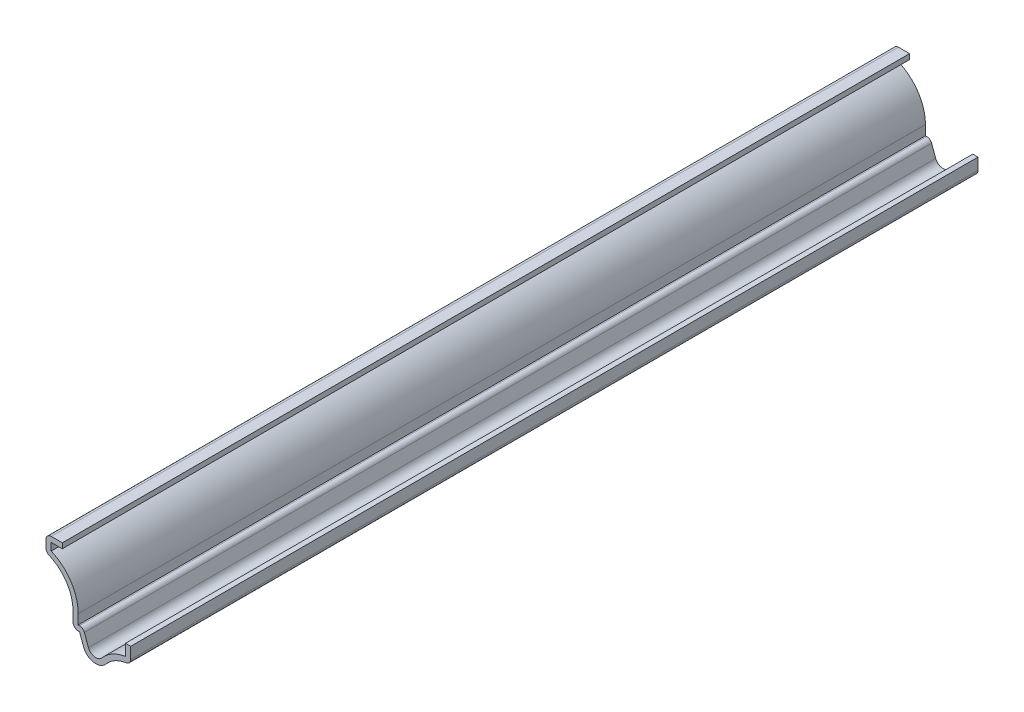
ISO-10303-21;
HEADER;
FILE_DESCRIPTION(('STEP AP214'),'2;1');
FILE_NAME('part.step','',(''),(''),'','','');
FILE_SCHEMA(('AUTOMOTIVE_DESIGN { 1 0 10303 214 1 1 1 1 }'));
ENDSEC;
DATA;
#1=APPLICATION_CONTEXT('core data for automotive mechanical design processes');
#2=APPLICATION_PROTOCOL_DEFINITION('international standard','automotive_design',2000,#1);
#3=PRODUCT_CONTEXT('',#1,'mechanical');
#4=PRODUCT('Part','Part','',(#3));
#5=PRODUCT_RELATED_PRODUCT_CATEGORY('part','',(#4));
#6=PRODUCT_DEFINITION_FORMATION('','',#4);
#7=PRODUCT_DEFINITION_CONTEXT('part definition',#1,'design');
#8=PRODUCT_DEFINITION('design','',#6,#7);
#9=PRODUCT_DEFINITION_SHAPE('','',#8);
#10=(LENGTH_UNIT() NAMED_UNIT(*) SI_UNIT(.MILLI.,.METRE.));
#11=(NAMED_UNIT(*) PLANE_ANGLE_UNIT() SI_UNIT($,.RADIAN.));
#12=(NAMED_UNIT(*) SI_UNIT($,.STERADIAN.) SOLID_ANGLE_UNIT());
#13=UNCERTAINTY_MEASURE_WITH_UNIT(LENGTH_MEASURE(1.E-05),#10,'distance_accuracy_value','');
#14=(GEOMETRIC_REPRESENTATION_CONTEXT(3) GLOBAL_UNCERTAINTY_ASSIGNED_CONTEXT((#13)) GLOBAL_UNIT_ASSIGNED_CONTEXT((#10,
#11,#12)) REPRESENTATION_CONTEXT('',''));
#15=CARTESIAN_POINT('',(0.,0.,0.));
#16=DIRECTION('',(0.,0.,1.));
#17=DIRECTION('',(1.,0.,0.));
#18=AXIS2_PLACEMENT_3D('',#15,#16,#17);
#19=CARTESIAN_POINT('',(-20.6375,20.16125,-206.375));
#20=DIRECTION('',(0.,-1.,0.));
#21=DIRECTION('',(0.,0.,-1.));
#22=AXIS2_PLACEMENT_3D('',#19,#20,#21);
#23=PLANE('',#22);
#24=DIRECTION('',(1.,0.,0.));
#25=VECTOR('',#24,1.);
#26=CARTESIAN_POINT('',(-20.6375,20.16125,0.));
#27=LINE('',#26,#25);
#28=CARTESIAN_POINT('',(-19.3675,20.16125,0.));
#29=VERTEX_POINT('',#28);
#30=CARTESIAN_POINT('',(-16.66875,20.16125,0.));
#31=VERTEX_POINT('',#30);
#32=EDGE_CURVE('E276',#29,#31,#27,.T.);
#33=ORIENTED_EDGE('',*,*,#32,.F.);
#34=DIRECTION('',(0.,0.,1.));
#35=VECTOR('',#34,1.);
#36=CARTESIAN_POINT('',(-19.3675,20.16125,-206.375));
#37=LINE('',#36,#35);
#38=CARTESIAN_POINT('',(-19.3675,20.16125,-206.375));
#39=VERTEX_POINT('',#38);
#40=EDGE_CURVE('E227',#39,#29,#37,.T.);
#41=ORIENTED_EDGE('',*,*,#40,.F.);
#42=DIRECTION('',(1.,0.,0.));
#43=VECTOR('',#42,1.);
#44=CARTESIAN_POINT('',(-20.6375,20.16125,-206.375));
#45=LINE('',#44,#43);
#46=CARTESIAN_POINT('',(-16.66875,20.16125,-206.375));
#47=VERTEX_POINT('',#46);
#48=EDGE_CURVE('E209',#39,#47,#45,.T.);
#49=ORIENTED_EDGE('',*,*,#48,.T.);
#50=DIRECTION('',(0.,0.,1.));
#51=VECTOR('',#50,1.);
#52=CARTESIAN_POINT('',(-16.66875,20.16125,-206.375));
#53=LINE('',#52,#51);
#54=EDGE_CURVE('E217',#47,#31,#53,.T.);
#55=ORIENTED_EDGE('',*,*,#54,.T.);
#56=EDGE_LOOP('',(#33,#41,#49,#55));
#57=FACE_BOUND('',#56,.T.);
#58=ADVANCED_FACE('F35',(#57),#23,.T.);
#59=CARTESIAN_POINT('',(-19.3675,17.4625,-206.375));
#60=DIRECTION('',(1.,0.,0.));
#61=DIRECTION('',(0.,0.,-1.));
#62=AXIS2_PLACEMENT_3D('',#59,#60,#61);
#63=PLANE('',#62);
#64=DIRECTION('',(0.,1.,0.));
#65=VECTOR('',#64,1.);
#66=CARTESIAN_POINT('',(-19.3675,17.4625,0.));
#67=LINE('',#66,#65);
#68=CARTESIAN_POINT('',(-19.3675,18.3412432116079,0.));
#69=VERTEX_POINT('',#68);
#70=EDGE_CURVE('E228',#69,#29,#67,.T.);
#71=ORIENTED_EDGE('',*,*,#70,.F.);
#72=DIRECTION('',(0.,0.,1.));
#73=VECTOR('',#72,1.);
#74=CARTESIAN_POINT('',(-19.3675,18.3412432116079,-206.375));
#75=LINE('',#74,#73);
#76=CARTESIAN_POINT('',(-19.3675,18.3412432116079,-206.375));
#77=VERTEX_POINT('',#76);
#78=EDGE_CURVE('E323',#77,#69,#75,.T.);
#79=ORIENTED_EDGE('',*,*,#78,.F.);
#80=DIRECTION('',(0.,1.,0.));
#81=VECTOR('',#80,1.);
#82=CARTESIAN_POINT('',(-19.3675,17.4625,-206.375));
#83=LINE('',#82,#81);
#84=EDGE_CURVE('E225',#77,#39,#83,.T.);
#85=ORIENTED_EDGE('',*,*,#84,.T.);
#86=ORIENTED_EDGE('',*,*,#40,.T.);
#87=EDGE_LOOP('',(#71,#79,#85,#86));
#88=FACE_BOUND('',#87,.T.);
#89=ADVANCED_FACE('F414',(#88),#63,.T.);
#90=CARTESIAN_POINT('',(-23.5932704527186,8.40771971382874,-206.375));
#91=DIRECTION('',(0.,0.,1.));
#92=DIRECTION('',(1.,0.,0.));
#93=AXIS2_PLACEMENT_3D('',#90,#91,#92);
#94=CYLINDRICAL_SURFACE('',#93,10.795);
#95=CARTESIAN_POINT('',(-23.5932704527186,8.40771971382874,0.));
#96=DIRECTION('',(0.,0.,1.));
#97=DIRECTION('',(1.,0.,0.));
#98=AXIS2_PLACEMENT_3D('',#95,#96,#97);
#99=CIRCLE('',#98,10.795);
#100=CARTESIAN_POINT('',(-12.7982704527186,8.40771971382874,0.));
#101=VERTEX_POINT('',#100);
#102=EDGE_CURVE('E231',#101,#69,#99,.T.);
#103=ORIENTED_EDGE('',*,*,#102,.F.);
#104=DIRECTION('',(0.,0.,1.));
#105=VECTOR('',#104,1.);
#106=CARTESIAN_POINT('',(-12.7982704527186,8.40771971382874,-206.375));
#107=LINE('',#106,#105);
#108=CARTESIAN_POINT('',(-12.7982704527186,8.40771971382874,-206.375));
#109=VERTEX_POINT('',#108);
#110=EDGE_CURVE('E325',#109,#101,#107,.T.);
#111=ORIENTED_EDGE('',*,*,#110,.F.);
#112=CARTESIAN_POINT('',(-23.5932704527186,8.40771971382874,-206.375));
#113=DIRECTION('',(0.,0.,1.));
#114=DIRECTION('',(1.,0.,0.));
#115=AXIS2_PLACEMENT_3D('',#112,#113,#114);
#116=CIRCLE('',#115,10.795);
#117=EDGE_CURVE('E272',#109,#77,#116,.T.);
#118=ORIENTED_EDGE('',*,*,#117,.T.);
#119=ORIENTED_EDGE('',*,*,#78,.T.);
#120=EDGE_LOOP('',(#103,#111,#118,#119));
#121=FACE_BOUND('',#120,.T.);
#122=ADVANCED_FACE('F500',(#121),#94,.T.);
#123=CARTESIAN_POINT('',(-12.7982704527186,4.7625,-206.375));
#124=DIRECTION('',(1.,0.,0.));
#125=DIRECTION('',(0.,0.,-1.));
#126=AXIS2_PLACEMENT_3D('',#123,#124,#125);
#127=PLANE('',#126);
#128=DIRECTION('',(0.,1.,0.));
#129=VECTOR('',#128,1.);
#130=CARTESIAN_POINT('',(-12.7982704527186,4.7625,0.));
#131=LINE('',#130,#129);
#132=CARTESIAN_POINT('',(-12.7982704527186,6.0325,0.));
#133=VERTEX_POINT('',#132);
#134=EDGE_CURVE('E316',#133,#101,#131,.T.);
#135=ORIENTED_EDGE('',*,*,#134,.F.);
#136=DIRECTION('',(0.,0.,1.));
#137=VECTOR('',#136,1.);
#138=CARTESIAN_POINT('',(-12.7982704527186,6.0325,-206.375));
#139=LINE('',#138,#137);
#140=CARTESIAN_POINT('',(-12.7982704527186,6.0325,-206.375));
#141=VERTEX_POINT('',#140);
#142=EDGE_CURVE('E327',#141,#133,#139,.T.);
#143=ORIENTED_EDGE('',*,*,#142,.F.);
#144=DIRECTION('',(0.,1.,0.));
#145=VECTOR('',#144,1.);
#146=CARTESIAN_POINT('',(-12.7982704527186,4.7625,-206.375));
#147=LINE('',#146,#145);
#148=EDGE_CURVE('E269',#141,#109,#147,.T.);
#149=ORIENTED_EDGE('',*,*,#148,.T.);
#150=ORIENTED_EDGE('',*,*,#110,.T.);
#151=EDGE_LOOP('',(#135,#143,#149,#150));
#152=FACE_BOUND('',#151,.T.);
#153=ADVANCED_FACE('F422',(#152),#127,.T.);
#154=CARTESIAN_POINT('',(-12.4807704527186,6.0325,-206.375));
#155=DIRECTION('',(0.,1.,0.));
#156=DIRECTION('',(0.,0.,1.));
#157=AXIS2_PLACEMENT_3D('',#154,#155,#156);
#158=PLANE('',#157);
#159=DIRECTION('',(1.,0.,0.));
#160=VECTOR('',#159,1.);
#161=CARTESIAN_POINT('',(-12.4807704527186,6.0325,0.));
#162=LINE('',#161,#160);
#163=CARTESIAN_POINT('',(-12.4807704527186,6.0325,0.));
#164=VERTEX_POINT('',#163);
#165=EDGE_CURVE('E314',#164,#133,#162,.F.);
#166=ORIENTED_EDGE('',*,*,#165,.F.);
#167=DIRECTION('',(0.,0.,1.));
#168=VECTOR('',#167,1.);
#169=CARTESIAN_POINT('',(-12.4807704527186,6.0325,-206.375));
#170=LINE('',#169,#168);
#171=CARTESIAN_POINT('',(-12.4807704527186,6.0325,-206.375));
#172=VERTEX_POINT('',#171);
#173=EDGE_CURVE('E385',#164,#172,#170,.F.);
#174=ORIENTED_EDGE('',*,*,#173,.T.);
#175=DIRECTION('',(1.,0.,0.));
#176=VECTOR('',#175,1.);
#177=CARTESIAN_POINT('',(-12.4807704527186,6.0325,-206.375));
#178=LINE('',#177,#176);
#179=EDGE_CURVE('E267',#172,#141,#178,.F.);
#180=ORIENTED_EDGE('',*,*,#179,.T.);
#181=ORIENTED_EDGE('',*,*,#142,.T.);
#182=EDGE_LOOP('',(#166,#174,#180,#181));
#183=FACE_BOUND('',#182,.T.);
#184=ADVANCED_FACE('F425',(#183),#158,.T.);
#185=CARTESIAN_POINT('',(-10.2995083961503,2.51628014142088,-206.375));
#186=DIRECTION('',(0.938313881066482,0.345784702666204,0.));
#187=DIRECTION('',(-0.345784702666204,0.938313881066482,0.));
#188=AXIS2_PLACEMENT_3D('',#185,#186,#187);
#189=PLANE('',#188);
#190=DIRECTION('',(-0.345784702666204,0.938313881066482,0.));
#191=VECTOR('',#190,1.);
#192=CARTESIAN_POINT('',(-10.2995083961503,2.51628014142088,-206.375));
#193=LINE('',#192,#191);
#194=CARTESIAN_POINT('',(-10.2995083961503,2.51628014142088,-206.375));
#195=VERTEX_POINT('',#194);
#196=CARTESIAN_POINT('',(-11.2891118237642,5.20164657238608,-206.375));
#197=VERTEX_POINT('',#196);
#198=EDGE_CURVE('E264',#195,#197,#193,.T.);
#199=ORIENTED_EDGE('',*,*,#198,.T.);
#200=DIRECTION('',(0.,0.,1.));
#201=VECTOR('',#200,1.);
#202=CARTESIAN_POINT('',(-11.2891118237642,5.20164657238608,-206.375));
#203=LINE('',#202,#201);
#204=CARTESIAN_POINT('',(-11.2891118237642,5.20164657238608,0.));
#205=VERTEX_POINT('',#204);
#206=EDGE_CURVE('E382',#197,#205,#203,.T.);
#207=ORIENTED_EDGE('',*,*,#206,.T.);
#208=DIRECTION('',(-0.345784702666204,0.938313881066482,0.));
#209=VECTOR('',#208,1.);
#210=CARTESIAN_POINT('',(-10.2995083961503,2.51628014142088,0.));
#211=LINE('',#210,#209);
#212=CARTESIAN_POINT('',(-10.2995083961503,2.51628014142088,0.));
#213=VERTEX_POINT('',#212);
#214=EDGE_CURVE('E311',#213,#205,#211,.T.);
#215=ORIENTED_EDGE('',*,*,#214,.F.);
#216=DIRECTION('',(0.,0.,1.));
#217=VECTOR('',#216,1.);
#218=CARTESIAN_POINT('',(-10.2995083961503,2.51628014142088,-206.375));
#219=LINE('',#218,#217);
#220=EDGE_CURVE('E330',#195,#213,#219,.T.);
#221=ORIENTED_EDGE('',*,*,#220,.F.);
#222=EDGE_LOOP('',(#199,#207,#215,#221));
#223=FACE_BOUND('',#222,.T.);
#224=ADVANCED_FACE('F434',(#223),#189,.T.);
#225=CARTESIAN_POINT('',(-8.51202045271861,3.175,-206.375));
#226=DIRECTION('',(0.,0.,1.));
#227=DIRECTION('',(1.,0.,0.));
#228=AXIS2_PLACEMENT_3D('',#225,#226,#227);
#229=CYLINDRICAL_SURFACE('',#228,1.905);
#230=CARTESIAN_POINT('',(-8.51202045271861,3.175,0.));
#231=DIRECTION('',(0.,0.,1.));
#232=DIRECTION('',(1.,0.,0.));
#233=AXIS2_PLACEMENT_3D('',#230,#231,#232);
#234=CIRCLE('',#233,1.905);
#235=CARTESIAN_POINT('',(-7.05281694653828,1.95035714285714,0.));
#236=VERTEX_POINT('',#235);
#237=EDGE_CURVE('E308',#236,#213,#234,.F.);
#238=ORIENTED_EDGE('',*,*,#237,.F.);
#239=DIRECTION('',(0.,0.,1.));
#240=VECTOR('',#239,1.);
#241=CARTESIAN_POINT('',(-7.05281694653828,1.95035714285714,-206.375));
#242=LINE('',#241,#240);
#243=CARTESIAN_POINT('',(-7.05281694653828,1.95035714285714,-206.375));
#244=VERTEX_POINT('',#243);
#245=EDGE_CURVE('E332',#244,#236,#242,.T.);
#246=ORIENTED_EDGE('',*,*,#245,.F.);
#247=CARTESIAN_POINT('',(-8.51202045271861,3.175,-206.375));
#248=DIRECTION('',(0.,0.,1.));
#249=DIRECTION('',(1.,0.,0.));
#250=AXIS2_PLACEMENT_3D('',#247,#248,#249);
#251=CIRCLE('',#250,1.905);
#252=EDGE_CURVE('E261',#244,#195,#251,.F.);
#253=ORIENTED_EDGE('',*,*,#252,.T.);
#254=ORIENTED_EDGE('',*,*,#220,.T.);
#255=EDGE_LOOP('',(#238,#246,#253,#254));
#256=FACE_BOUND('',#255,.T.);
#257=ADVANCED_FACE('F438',(#256),#229,.F.);
#258=CARTESIAN_POINT('',(0.,-3.96875,-206.375));
#259=DIRECTION('',(0.,0.,1.));
#260=DIRECTION('',(1.,0.,0.));
#261=AXIS2_PLACEMENT_3D('',#258,#259,#260);
#262=CYLINDRICAL_SURFACE('',#261,9.2075);
#263=CARTESIAN_POINT('',(0.,-3.96875,0.));
#264=DIRECTION('',(0.,0.,1.));
#265=DIRECTION('',(1.,0.,0.));
#266=AXIS2_PLACEMENT_3D('',#263,#264,#265);
#267=CIRCLE('',#266,9.2075);
#268=CARTESIAN_POINT('',(-1.27,5.15074320137912,0.));
#269=VERTEX_POINT('',#268);
#270=EDGE_CURVE('E305',#269,#236,#267,.T.);
#271=ORIENTED_EDGE('',*,*,#270,.F.);
#272=DIRECTION('',(0.,0.,1.));
#273=VECTOR('',#272,1.);
#274=CARTESIAN_POINT('',(-1.27,5.15074320137912,-206.375));
#275=LINE('',#274,#273);
#276=CARTESIAN_POINT('',(-1.27,5.15074320137912,-206.375));
#277=VERTEX_POINT('',#276);
#278=EDGE_CURVE('E334',#277,#269,#275,.T.);
#279=ORIENTED_EDGE('',*,*,#278,.F.);
#280=CARTESIAN_POINT('',(0.,-3.96875,-206.375));
#281=DIRECTION('',(0.,0.,1.));
#282=DIRECTION('',(1.,0.,0.));
#283=AXIS2_PLACEMENT_3D('',#280,#281,#282);
#284=CIRCLE('',#283,9.2075);
#285=EDGE_CURVE('E258',#277,#244,#284,.T.);
#286=ORIENTED_EDGE('',*,*,#285,.T.);
#287=ORIENTED_EDGE('',*,*,#245,.T.);
#288=EDGE_LOOP('',(#271,#279,#286,#287));
#289=FACE_BOUND('',#288,.T.);
#290=ADVANCED_FACE('F443',(#289),#262,.T.);
#291=CARTESIAN_POINT('',(-1.27,7.9375,-206.375));
#292=DIRECTION('',(-1.,0.,0.));
#293=DIRECTION('',(0.,-1.,0.));
#294=AXIS2_PLACEMENT_3D('',#291,#292,#293);
#295=PLANE('',#294);
#296=DIRECTION('',(0.,-1.,0.));
#297=VECTOR('',#296,1.);
#298=CARTESIAN_POINT('',(-1.27,7.9375,0.));
#299=LINE('',#298,#297);
#300=CARTESIAN_POINT('',(-1.27,7.9375,0.));
#301=VERTEX_POINT('',#300);
#302=EDGE_CURVE('E302',#301,#269,#299,.T.);
#303=ORIENTED_EDGE('',*,*,#302,.F.);
#304=DIRECTION('',(0.,0.,1.));
#305=VECTOR('',#304,1.);
#306=CARTESIAN_POINT('',(-1.27,7.9375,-206.375));
#307=LINE('',#306,#305);
#308=CARTESIAN_POINT('',(-1.27,7.9375,-206.375));
#309=VERTEX_POINT('',#308);
#310=EDGE_CURVE('E336',#309,#301,#307,.T.);
#311=ORIENTED_EDGE('',*,*,#310,.F.);
#312=DIRECTION('',(0.,-1.,0.));
#313=VECTOR('',#312,1.);
#314=CARTESIAN_POINT('',(-1.27,7.9375,-206.375));
#315=LINE('',#314,#313);
#316=EDGE_CURVE('E255',#309,#277,#315,.T.);
#317=ORIENTED_EDGE('',*,*,#316,.T.);
#318=ORIENTED_EDGE('',*,*,#278,.T.);
#319=EDGE_LOOP('',(#303,#311,#317,#318));
#320=FACE_BOUND('',#319,.T.);
#321=ADVANCED_FACE('F446',(#320),#295,.T.);
#322=CARTESIAN_POINT('',(-1.27,7.9375,-206.375));
#323=DIRECTION('',(0.,-1.,0.));
#324=DIRECTION('',(0.,0.,-1.));
#325=AXIS2_PLACEMENT_3D('',#322,#323,#324);
#326=PLANE('',#325);
#327=DIRECTION('',(1.,0.,0.));
#328=VECTOR('',#327,1.);
#329=CARTESIAN_POINT('',(-1.27,7.9375,0.));
#330=LINE('',#329,#328);
#331=CARTESIAN_POINT('',(0.,7.9375,0.));
#332=VERTEX_POINT('',#331);
#333=EDGE_CURVE('E300',#301,#332,#330,.T.);
#334=ORIENTED_EDGE('',*,*,#333,.T.);
#335=DIRECTION('',(0.,0.,1.));
#336=VECTOR('',#335,1.);
#337=CARTESIAN_POINT('',(0.,7.9375,-206.375));
#338=LINE('',#337,#336);
#339=CARTESIAN_POINT('',(0.,7.9375,-206.375));
#340=VERTEX_POINT('',#339);
#341=EDGE_CURVE('E338',#340,#332,#338,.T.);
#342=ORIENTED_EDGE('',*,*,#341,.F.);
#343=DIRECTION('',(1.,0.,0.));
#344=VECTOR('',#343,1.);
#345=CARTESIAN_POINT('',(-1.27,7.9375,-206.375));
#346=LINE('',#345,#344);
#347=EDGE_CURVE('E253',#309,#340,#346,.T.);
#348=ORIENTED_EDGE('',*,*,#347,.F.);
#349=ORIENTED_EDGE('',*,*,#310,.T.);
#350=EDGE_LOOP('',(#334,#342,#348,#349));
#351=FACE_BOUND('',#350,.T.);
#352=ADVANCED_FACE('F452',(#351),#326,.F.);
#353=CARTESIAN_POINT('',(0.,7.9375,-206.375));
#354=DIRECTION('',(-1.,0.,0.));
#355=DIRECTION('',(0.,-1.,0.));
#356=AXIS2_PLACEMENT_3D('',#353,#354,#355);
#357=PLANE('',#356);
#358=DIRECTION('',(0.,-1.,0.));
#359=VECTOR('',#358,1.);
#360=CARTESIAN_POINT('',(0.,7.9375,0.));
#361=LINE('',#360,#359);
#362=CARTESIAN_POINT('',(0.,5.15074320137912,0.));
#363=VERTEX_POINT('',#362);
#364=EDGE_CURVE('E297',#332,#363,#361,.T.);
#365=ORIENTED_EDGE('',*,*,#364,.T.);
#366=DIRECTION('',(0.,0.,1.));
#367=VECTOR('',#366,1.);
#368=CARTESIAN_POINT('',(0.,5.15074320137912,-206.375));
#369=LINE('',#368,#367);
#370=CARTESIAN_POINT('',(0.,5.15074320137912,-206.375));
#371=VERTEX_POINT('',#370);
#372=EDGE_CURVE('E366',#363,#371,#369,.F.);
#373=ORIENTED_EDGE('',*,*,#372,.T.);
#374=DIRECTION('',(0.,-1.,0.));
#375=VECTOR('',#374,1.);
#376=CARTESIAN_POINT('',(0.,7.9375,-206.375));
#377=LINE('',#376,#375);
#378=EDGE_CURVE('E251',#340,#371,#377,.T.);
#379=ORIENTED_EDGE('',*,*,#378,.F.);
#380=ORIENTED_EDGE('',*,*,#341,.T.);
#381=EDGE_LOOP('',(#365,#373,#379,#380));
#382=FACE_BOUND('',#381,.T.);
#383=ADVANCED_FACE('F456',(#382),#357,.F.);
#384=CARTESIAN_POINT('',(0.,-3.96875,-206.375));
#385=DIRECTION('',(0.,0.,1.));
#386=DIRECTION('',(1.,0.,0.));
#387=AXIS2_PLACEMENT_3D('',#384,#385,#386);
#388=CYLINDRICAL_SURFACE('',#387,7.9375);
#389=CARTESIAN_POINT('',(0.,-3.96875,-206.375));
#390=DIRECTION('',(0.,0.,1.));
#391=DIRECTION('',(1.,0.,0.));
#392=AXIS2_PLACEMENT_3D('',#389,#390,#391);
#393=CIRCLE('',#392,7.9375);
#394=CARTESIAN_POINT('',(-1.0948275862069,3.89288207015441,-206.375));
#395=VERTEX_POINT('',#394);
#396=CARTESIAN_POINT('',(-6.08001460908472,1.13392857142857,-206.375));
#397=VERTEX_POINT('',#396);
#398=EDGE_CURVE('E249',#395,#397,#393,.T.);
#399=ORIENTED_EDGE('',*,*,#398,.F.);
#400=DIRECTION('',(0.,0.,1.));
#401=VECTOR('',#400,1.);
#402=CARTESIAN_POINT('',(-1.0948275862069,3.89288207015442,-206.375));
#403=LINE('',#402,#401);
#404=CARTESIAN_POINT('',(-1.0948275862069,3.89288207015441,0.));
#405=VERTEX_POINT('',#404);
#406=EDGE_CURVE('E322',#395,#405,#403,.T.);
#407=ORIENTED_EDGE('',*,*,#406,.T.);
#408=CARTESIAN_POINT('',(0.,-3.96875,0.));
#409=DIRECTION('',(0.,0.,1.));
#410=DIRECTION('',(1.,0.,0.));
#411=AXIS2_PLACEMENT_3D('',#408,#409,#410);
#412=CIRCLE('',#411,7.9375);
#413=CARTESIAN_POINT('',(-6.08001460908472,1.13392857142857,0.));
#414=VERTEX_POINT('',#413);
#415=EDGE_CURVE('E295',#405,#414,#412,.T.);
#416=ORIENTED_EDGE('',*,*,#415,.T.);
#417=DIRECTION('',(0.,0.,1.));
#418=VECTOR('',#417,1.);
#419=CARTESIAN_POINT('',(-6.08001460908472,1.13392857142857,-206.375));
#420=LINE('',#419,#418);
#421=EDGE_CURVE('E341',#397,#414,#420,.T.);
#422=ORIENTED_EDGE('',*,*,#421,.F.);
#423=EDGE_LOOP('',(#399,#407,#416,#422));
#424=FACE_BOUND('',#423,.T.);
#425=ADVANCED_FACE('F464',(#424),#388,.F.);
#426=CARTESIAN_POINT('',(-8.51202045271861,3.175,-206.375));
#427=DIRECTION('',(0.,0.,1.));
#428=DIRECTION('',(1.,0.,0.));
#429=AXIS2_PLACEMENT_3D('',#426,#427,#428);
#430=CYLINDRICAL_SURFACE('',#429,3.175);
#431=CARTESIAN_POINT('',(-8.51202045271861,3.175,0.));
#432=DIRECTION('',(0.,0.,-1.));
#433=DIRECTION('',(-1.,0.,0.));
#434=AXIS2_PLACEMENT_3D('',#431,#432,#433);
#435=CIRCLE('',#434,3.175);
#436=CARTESIAN_POINT('',(-11.4911670251047,2.0771335690348,0.));
#437=VERTEX_POINT('',#436);
#438=EDGE_CURVE('E293',#414,#437,#435,.T.);
#439=ORIENTED_EDGE('',*,*,#438,.T.);
#440=DIRECTION('',(0.,0.,1.));
#441=VECTOR('',#440,1.);
#442=CARTESIAN_POINT('',(-11.4911670251047,2.0771335690348,-206.375));
#443=LINE('',#442,#441);
#444=CARTESIAN_POINT('',(-11.4911670251047,2.0771335690348,-206.375));
#445=VERTEX_POINT('',#444);
#446=EDGE_CURVE('E344',#445,#437,#443,.T.);
#447=ORIENTED_EDGE('',*,*,#446,.F.);
#448=CARTESIAN_POINT('',(-8.51202045271861,3.175,-206.375));
#449=DIRECTION('',(0.,0.,-1.));
#450=DIRECTION('',(-1.,0.,0.));
#451=AXIS2_PLACEMENT_3D('',#448,#449,#450);
#452=CIRCLE('',#451,3.175);
#453=EDGE_CURVE('E247',#397,#445,#452,.T.);
#454=ORIENTED_EDGE('',*,*,#453,.F.);
#455=ORIENTED_EDGE('',*,*,#421,.T.);
#456=EDGE_LOOP('',(#439,#447,#454,#455));
#457=FACE_BOUND('',#456,.T.);
#458=ADVANCED_FACE('F469',(#457),#430,.T.);
#459=CARTESIAN_POINT('',(-11.4911670251047,2.0771335690348,-206.375));
#460=DIRECTION('',(0.938313881066482,0.345784702666204,0.));
#461=DIRECTION('',(-0.345784702666204,0.938313881066482,0.));
#462=AXIS2_PLACEMENT_3D('',#459,#460,#461);
#463=PLANE('',#462);
#464=DIRECTION('',(-0.345784702666204,0.938313881066482,0.));
#465=VECTOR('',#464,1.);
#466=CARTESIAN_POINT('',(-11.4911670251047,2.0771335690348,0.));
#467=LINE('',#466,#465);
#468=CARTESIAN_POINT('',(-12.4807704527186,4.7625,0.));
#469=VERTEX_POINT('',#468);
#470=EDGE_CURVE('E291',#437,#469,#467,.T.);
#471=ORIENTED_EDGE('',*,*,#470,.T.);
#472=DIRECTION('',(0.,0.,1.));
#473=VECTOR('',#472,1.);
#474=CARTESIAN_POINT('',(-12.4807704527186,4.7625,-206.375));
#475=LINE('',#474,#473);
#476=CARTESIAN_POINT('',(-12.4807704527186,4.7625,-206.375));
#477=VERTEX_POINT('',#476);
#478=EDGE_CURVE('E347',#477,#469,#475,.T.);
#479=ORIENTED_EDGE('',*,*,#478,.F.);
#480=DIRECTION('',(-0.345784702666204,0.938313881066482,0.));
#481=VECTOR('',#480,1.);
#482=CARTESIAN_POINT('',(-11.4911670251047,2.0771335690348,-206.375));
#483=LINE('',#482,#481);
#484=EDGE_CURVE('E245',#445,#477,#483,.T.);
#485=ORIENTED_EDGE('',*,*,#484,.F.);
#486=ORIENTED_EDGE('',*,*,#446,.T.);
#487=EDGE_LOOP('',(#471,#479,#485,#486));
#488=FACE_BOUND('',#487,.T.);
#489=ADVANCED_FACE('F475',(#488),#463,.F.);
#490=CARTESIAN_POINT('',(-12.4807704527186,4.7625,-206.375));
#491=DIRECTION('',(0.,1.,0.));
#492=DIRECTION('',(0.,0.,1.));
#493=AXIS2_PLACEMENT_3D('',#490,#491,#492);
#494=PLANE('',#493);
#495=DIRECTION('',(-1.,0.,0.));
#496=VECTOR('',#495,1.);
#497=CARTESIAN_POINT('',(-12.4807704527186,4.7625,0.));
#498=LINE('',#497,#496);
#499=CARTESIAN_POINT('',(-12.7982704527186,4.7625,0.));
#500=VERTEX_POINT('',#499);
#501=EDGE_CURVE('E288',#469,#500,#498,.T.);
#502=ORIENTED_EDGE('',*,*,#501,.T.);
#503=DIRECTION('',(0.,0.,1.));
#504=VECTOR('',#503,1.);
#505=CARTESIAN_POINT('',(-12.7982704527186,4.7625,-206.375));
#506=LINE('',#505,#504);
#507=CARTESIAN_POINT('',(-12.7982704527186,4.7625,-206.375));
#508=VERTEX_POINT('',#507);
#509=EDGE_CURVE('E380',#500,#508,#506,.F.);
#510=ORIENTED_EDGE('',*,*,#509,.T.);
#511=DIRECTION('',(-1.,0.,0.));
#512=VECTOR('',#511,1.);
#513=CARTESIAN_POINT('',(-12.4807704527186,4.7625,-206.375));
#514=LINE('',#513,#512);
#515=EDGE_CURVE('E242',#477,#508,#514,.T.);
#516=ORIENTED_EDGE('',*,*,#515,.F.);
#517=ORIENTED_EDGE('',*,*,#478,.T.);
#518=EDGE_LOOP('',(#502,#510,#516,#517));
#519=FACE_BOUND('',#518,.T.);
#520=ADVANCED_FACE('F479',(#519),#494,.F.);
#521=CARTESIAN_POINT('',(-14.0682704527186,4.7625,-206.375));
#522=DIRECTION('',(1.,0.,0.));
#523=DIRECTION('',(0.,0.,-1.));
#524=AXIS2_PLACEMENT_3D('',#521,#522,#523);
#525=PLANE('',#524);
#526=DIRECTION('',(0.,1.,0.));
#527=VECTOR('',#526,1.);
#528=CARTESIAN_POINT('',(-14.0682704527186,4.7625,-206.375));
#529=LINE('',#528,#527);
#530=CARTESIAN_POINT('',(-14.0682704527186,6.0325,-206.375));
#531=VERTEX_POINT('',#530);
#532=CARTESIAN_POINT('',(-14.0682704527186,8.40771971382874,-206.375));
#533=VERTEX_POINT('',#532);
#534=EDGE_CURVE('E240',#531,#533,#529,.T.);
#535=ORIENTED_EDGE('',*,*,#534,.F.);
#536=DIRECTION('',(0.,0.,1.));
#537=VECTOR('',#536,1.);
#538=CARTESIAN_POINT('',(-14.0682704527186,6.0325,-206.375));
#539=LINE('',#538,#537);
#540=CARTESIAN_POINT('',(-14.0682704527186,6.0325,0.));
#541=VERTEX_POINT('',#540);
#542=EDGE_CURVE('E377',#531,#541,#539,.T.);
#543=ORIENTED_EDGE('',*,*,#542,.T.);
#544=DIRECTION('',(0.,1.,0.));
#545=VECTOR('',#544,1.);
#546=CARTESIAN_POINT('',(-14.0682704527186,4.7625,0.));
#547=LINE('',#546,#545);
#548=CARTESIAN_POINT('',(-14.0682704527186,8.40771971382874,0.));
#549=VERTEX_POINT('',#548);
#550=EDGE_CURVE('E286',#541,#549,#547,.T.);
#551=ORIENTED_EDGE('',*,*,#550,.T.);
#552=DIRECTION('',(0.,0.,1.));
#553=VECTOR('',#552,1.);
#554=CARTESIAN_POINT('',(-14.0682704527186,8.40771971382874,-206.375));
#555=LINE('',#554,#553);
#556=EDGE_CURVE('E350',#533,#549,#555,.T.);
#557=ORIENTED_EDGE('',*,*,#556,.F.);
#558=EDGE_LOOP('',(#535,#543,#551,#557));
#559=FACE_BOUND('',#558,.T.);
#560=ADVANCED_FACE('F485',(#559),#525,.F.);
#561=CARTESIAN_POINT('',(-23.5932704527186,8.40771971382874,-206.375));
#562=DIRECTION('',(0.,0.,1.));
#563=DIRECTION('',(1.,0.,0.));
#564=AXIS2_PLACEMENT_3D('',#561,#562,#563);
#565=CYLINDRICAL_SURFACE('',#564,9.525);
#566=CARTESIAN_POINT('',(-23.5932704527186,8.40771971382874,0.));
#567=DIRECTION('',(0.,0.,1.));
#568=DIRECTION('',(1.,0.,0.));
#569=AXIS2_PLACEMENT_3D('',#566,#567,#568);
#570=CIRCLE('',#569,9.525);
#571=CARTESIAN_POINT('',(-19.8646494650257,17.1725933883397,0.));
#572=VERTEX_POINT('',#571);
#573=EDGE_CURVE('E283',#549,#572,#570,.T.);
#574=ORIENTED_EDGE('',*,*,#573,.T.);
#575=DIRECTION('',(0.,0.,1.));
#576=VECTOR('',#575,1.);
#577=CARTESIAN_POINT('',(-19.8646494650257,17.1725933883397,-206.375));
#578=LINE('',#577,#576);
#579=CARTESIAN_POINT('',(-19.8646494650257,17.1725933883397,-206.375));
#580=VERTEX_POINT('',#579);
#581=EDGE_CURVE('E43',#572,#580,#578,.F.);
#582=ORIENTED_EDGE('',*,*,#581,.T.);
#583=CARTESIAN_POINT('',(-23.5932704527186,8.40771971382874,-206.375));
#584=DIRECTION('',(0.,0.,1.));
#585=DIRECTION('',(1.,0.,0.));
#586=AXIS2_PLACEMENT_3D('',#583,#584,#585);
#587=CIRCLE('',#586,9.525);
#588=EDGE_CURVE('E237',#533,#580,#587,.T.);
#589=ORIENTED_EDGE('',*,*,#588,.F.);
#590=ORIENTED_EDGE('',*,*,#556,.T.);
#591=EDGE_LOOP('',(#574,#582,#589,#590));
#592=FACE_BOUND('',#591,.T.);
#593=ADVANCED_FACE('F393',(#592),#565,.F.);
#594=CARTESIAN_POINT('',(-20.6375,17.4625,-206.375));
#595=DIRECTION('',(1.,0.,0.));
#596=DIRECTION('',(0.,0.,-1.));
#597=AXIS2_PLACEMENT_3D('',#594,#595,#596);
#598=PLANE('',#597);
#599=DIRECTION('',(0.,1.,0.));
#600=VECTOR('',#599,1.);
#601=CARTESIAN_POINT('',(-20.6375,17.4625,-206.375));
#602=LINE('',#601,#600);
#603=CARTESIAN_POINT('',(-20.6375,18.3412432116079,-206.375));
#604=VERTEX_POINT('',#603);
#605=CARTESIAN_POINT('',(-20.6375,20.16125,-206.375));
#606=VERTEX_POINT('',#605);
#607=EDGE_CURVE('E235',#604,#606,#602,.T.);
#608=ORIENTED_EDGE('',*,*,#607,.F.);
#609=DIRECTION('',(0.,0.,1.));
#610=VECTOR('',#609,1.);
#611=CARTESIAN_POINT('',(-20.6375,18.3412432116079,-206.375));
#612=LINE('',#611,#610);
#613=CARTESIAN_POINT('',(-20.6375,18.3412432116079,0.));
#614=VERTEX_POINT('',#613);
#615=EDGE_CURVE('E388',#604,#614,#612,.T.);
#616=ORIENTED_EDGE('',*,*,#615,.T.);
#617=DIRECTION('',(0.,1.,0.));
#618=VECTOR('',#617,1.);
#619=CARTESIAN_POINT('',(-20.6375,17.4625,0.));
#620=LINE('',#619,#618);
#621=CARTESIAN_POINT('',(-20.6375,20.16125,0.));
#622=VERTEX_POINT('',#621);
#623=EDGE_CURVE('E281',#614,#622,#620,.T.);
#624=ORIENTED_EDGE('',*,*,#623,.T.);
#625=DIRECTION('',(0.,0.,1.));
#626=VECTOR('',#625,1.);
#627=CARTESIAN_POINT('',(-20.6375,20.16125,-206.375));
#628=LINE('',#627,#626);
#629=EDGE_CURVE('E58',#622,#606,#628,.F.);
#630=ORIENTED_EDGE('',*,*,#629,.T.);
#631=EDGE_LOOP('',(#608,#616,#624,#630));
#632=FACE_BOUND('',#631,.T.);
#633=ADVANCED_FACE('F402',(#632),#598,.F.);
#634=CARTESIAN_POINT('',(-20.6375,21.43125,-206.375));
#635=DIRECTION('',(0.,-1.,0.));
#636=DIRECTION('',(0.,0.,-1.));
#637=AXIS2_PLACEMENT_3D('',#634,#635,#636);
#638=PLANE('',#637);
#639=DIRECTION('',(1.,0.,0.));
#640=VECTOR('',#639,1.);
#641=CARTESIAN_POINT('',(-20.6375,21.43125,-206.375));
#642=LINE('',#641,#640);
#643=CARTESIAN_POINT('',(-19.3675,21.43125,-206.375));
#644=VERTEX_POINT('',#643);
#645=CARTESIAN_POINT('',(-16.66875,21.43125,-206.375));
#646=VERTEX_POINT('',#645);
#647=EDGE_CURVE('E211',#644,#646,#642,.T.);
#648=ORIENTED_EDGE('',*,*,#647,.F.);
#649=DIRECTION('',(0.,0.,1.));
#650=VECTOR('',#649,1.);
#651=CARTESIAN_POINT('',(-19.3675,21.43125,-206.375));
#652=LINE('',#651,#650);
#653=CARTESIAN_POINT('',(-19.3675,21.43125,0.));
#654=VERTEX_POINT('',#653);
#655=EDGE_CURVE('E11',#644,#654,#652,.T.);
#656=ORIENTED_EDGE('',*,*,#655,.T.);
#657=DIRECTION('',(1.,0.,0.));
#658=VECTOR('',#657,1.);
#659=CARTESIAN_POINT('',(-20.6375,21.43125,0.));
#660=LINE('',#659,#658);
#661=CARTESIAN_POINT('',(-16.66875,21.43125,0.));
#662=VERTEX_POINT('',#661);
#663=EDGE_CURVE('E279',#654,#662,#660,.T.);
#664=ORIENTED_EDGE('',*,*,#663,.T.);
#665=DIRECTION('',(0.,0.,1.));
#666=VECTOR('',#665,1.);
#667=CARTESIAN_POINT('',(-16.66875,21.43125,-206.375));
#668=LINE('',#667,#666);
#669=EDGE_CURVE('E224',#646,#662,#668,.T.);
#670=ORIENTED_EDGE('',*,*,#669,.F.);
#671=EDGE_LOOP('',(#648,#656,#664,#670));
#672=FACE_BOUND('',#671,.T.);
#673=ADVANCED_FACE('F410',(#672),#638,.F.);
#674=CARTESIAN_POINT('',(-16.66875,21.43125,-206.375));
#675=DIRECTION('',(-1.,0.,0.));
#676=DIRECTION('',(0.,0.,1.));
#677=AXIS2_PLACEMENT_3D('',#674,#675,#676);
#678=PLANE('',#677);
#679=DIRECTION('',(0.,-1.,0.));
#680=VECTOR('',#679,1.);
#681=CARTESIAN_POINT('',(-16.66875,21.43125,0.));
#682=LINE('',#681,#680);
#683=EDGE_CURVE('E220',#662,#31,#682,.T.);
#684=ORIENTED_EDGE('',*,*,#683,.T.);
#685=ORIENTED_EDGE('',*,*,#54,.F.);
#686=DIRECTION('',(0.,-1.,0.));
#687=VECTOR('',#686,1.);
#688=CARTESIAN_POINT('',(-16.66875,21.43125,-206.375));
#689=LINE('',#688,#687);
#690=EDGE_CURVE('E203',#646,#47,#689,.T.);
#691=ORIENTED_EDGE('',*,*,#690,.F.);
#692=ORIENTED_EDGE('',*,*,#669,.T.);
#693=EDGE_LOOP('',(#684,#685,#691,#692));
#694=FACE_BOUND('',#693,.T.);
#695=ADVANCED_FACE('F218',(#694),#678,.F.);
#696=CARTESIAN_POINT('',(-23.5932704527186,8.40771971382874,-206.375));
#697=DIRECTION('',(0.,0.,1.));
#698=DIRECTION('',(1.,0.,0.));
#699=AXIS2_PLACEMENT_3D('',#696,#697,#698);
#700=PLANE('',#699);
#701=ORIENTED_EDGE('',*,*,#378,.T.);
#702=CARTESIAN_POINT('',(-1.27,5.15074320137912,-206.375));
#703=DIRECTION('',(0.,0.,1.));
#704=DIRECTION('',(1.,0.,0.));
#705=AXIS2_PLACEMENT_3D('',#702,#703,#704);
#706=CIRCLE('',#705,1.27);
#707=EDGE_CURVE('E375',#371,#395,#706,.F.);
#708=ORIENTED_EDGE('',*,*,#707,.T.);
#709=ORIENTED_EDGE('',*,*,#398,.T.);
#710=ORIENTED_EDGE('',*,*,#453,.T.);
#711=ORIENTED_EDGE('',*,*,#484,.T.);
#712=ORIENTED_EDGE('',*,*,#515,.T.);
#713=CARTESIAN_POINT('',(-12.7982704527186,6.0325,-206.375));
#714=DIRECTION('',(0.,0.,1.));
#715=DIRECTION('',(1.,0.,0.));
#716=AXIS2_PLACEMENT_3D('',#713,#714,#715);
#717=CIRCLE('',#716,1.27);
#718=EDGE_CURVE('E373',#508,#531,#717,.F.);
#719=ORIENTED_EDGE('',*,*,#718,.T.);
#720=ORIENTED_EDGE('',*,*,#534,.T.);
#721=ORIENTED_EDGE('',*,*,#588,.T.);
#722=CARTESIAN_POINT('',(-19.3675,18.3412432116079,-206.375));
#723=DIRECTION('',(0.,0.,1.));
#724=DIRECTION('',(1.,0.,0.));
#725=AXIS2_PLACEMENT_3D('',#722,#723,#724);
#726=CIRCLE('',#725,1.27);
#727=EDGE_CURVE('E369',#580,#604,#726,.F.);
#728=ORIENTED_EDGE('',*,*,#727,.T.);
#729=ORIENTED_EDGE('',*,*,#607,.T.);
#730=CARTESIAN_POINT('',(-19.3675,20.16125,-206.375));
#731=DIRECTION('',(0.,0.,1.));
#732=DIRECTION('',(1.,0.,0.));
#733=AXIS2_PLACEMENT_3D('',#730,#731,#732);
#734=CIRCLE('',#733,1.27);
#735=EDGE_CURVE('E50',#606,#644,#734,.F.);
#736=ORIENTED_EDGE('',*,*,#735,.T.);
#737=ORIENTED_EDGE('',*,*,#647,.T.);
#738=ORIENTED_EDGE('',*,*,#690,.T.);
#739=ORIENTED_EDGE('',*,*,#48,.F.);
#740=ORIENTED_EDGE('',*,*,#84,.F.);
#741=ORIENTED_EDGE('',*,*,#117,.F.);
#742=ORIENTED_EDGE('',*,*,#148,.F.);
#743=ORIENTED_EDGE('',*,*,#179,.F.);
#744=CARTESIAN_POINT('',(-12.4807704527186,4.7625,-206.375));
#745=DIRECTION('',(0.,0.,1.));
#746=DIRECTION('',(1.,0.,0.));
#747=AXIS2_PLACEMENT_3D('',#744,#745,#746);
#748=CIRCLE('',#747,1.27);
#749=EDGE_CURVE('E371',#172,#197,#748,.F.);
#750=ORIENTED_EDGE('',*,*,#749,.T.);
#751=ORIENTED_EDGE('',*,*,#198,.F.);
#752=ORIENTED_EDGE('',*,*,#252,.F.);
#753=ORIENTED_EDGE('',*,*,#285,.F.);
#754=ORIENTED_EDGE('',*,*,#316,.F.);
#755=ORIENTED_EDGE('',*,*,#347,.T.);
#756=EDGE_LOOP('',(#701,#708,#709,#710,#711,#712,#719,#720,#721,#728,#729,#736,#737,#738,#739,
#740,#741,#742,#743,#750,#751,#752,#753,#754,#755));
#757=FACE_BOUND('',#756,.T.);
#758=ADVANCED_FACE('F206',(#757),#700,.F.);
#759=CARTESIAN_POINT('',(-23.5932704527186,8.40771971382874,0.));
#760=DIRECTION('',(0.,0.,1.));
#761=DIRECTION('',(1.,0.,0.));
#762=AXIS2_PLACEMENT_3D('',#759,#760,#761);
#763=PLANE('',#762);
#764=ORIENTED_EDGE('',*,*,#415,.F.);
#765=CARTESIAN_POINT('',(-1.27,5.15074320137912,0.));
#766=DIRECTION('',(0.,0.,1.));
#767=DIRECTION('',(1.,0.,0.));
#768=AXIS2_PLACEMENT_3D('',#765,#766,#767);
#769=CIRCLE('',#768,1.27);
#770=EDGE_CURVE('E364',#405,#363,#769,.T.);
#771=ORIENTED_EDGE('',*,*,#770,.T.);
#772=ORIENTED_EDGE('',*,*,#364,.F.);
#773=ORIENTED_EDGE('',*,*,#333,.F.);
#774=ORIENTED_EDGE('',*,*,#302,.T.);
#775=ORIENTED_EDGE('',*,*,#270,.T.);
#776=ORIENTED_EDGE('',*,*,#237,.T.);
#777=ORIENTED_EDGE('',*,*,#214,.T.);
#778=CARTESIAN_POINT('',(-12.4807704527186,4.7625,0.));
#779=DIRECTION('',(0.,0.,1.));
#780=DIRECTION('',(1.,0.,0.));
#781=AXIS2_PLACEMENT_3D('',#778,#779,#780);
#782=CIRCLE('',#781,1.27);
#783=EDGE_CURVE('E360',#205,#164,#782,.T.);
#784=ORIENTED_EDGE('',*,*,#783,.T.);
#785=ORIENTED_EDGE('',*,*,#165,.T.);
#786=ORIENTED_EDGE('',*,*,#134,.T.);
#787=ORIENTED_EDGE('',*,*,#102,.T.);
#788=ORIENTED_EDGE('',*,*,#70,.T.);
#789=ORIENTED_EDGE('',*,*,#32,.T.);
#790=ORIENTED_EDGE('',*,*,#683,.F.);
#791=ORIENTED_EDGE('',*,*,#663,.F.);
#792=CARTESIAN_POINT('',(-19.3675,20.16125,0.));
#793=DIRECTION('',(0.,0.,1.));
#794=DIRECTION('',(1.,0.,0.));
#795=AXIS2_PLACEMENT_3D('',#792,#793,#794);
#796=CIRCLE('',#795,1.27);
#797=EDGE_CURVE('E356',#654,#622,#796,.T.);
#798=ORIENTED_EDGE('',*,*,#797,.T.);
#799=ORIENTED_EDGE('',*,*,#623,.F.);
#800=CARTESIAN_POINT('',(-19.3675,18.3412432116079,0.));
#801=DIRECTION('',(0.,0.,1.));
#802=DIRECTION('',(1.,0.,0.));
#803=AXIS2_PLACEMENT_3D('',#800,#801,#802);
#804=CIRCLE('',#803,1.27);
#805=EDGE_CURVE('E358',#614,#572,#804,.T.);
#806=ORIENTED_EDGE('',*,*,#805,.T.);
#807=ORIENTED_EDGE('',*,*,#573,.F.);
#808=ORIENTED_EDGE('',*,*,#550,.F.);
#809=CARTESIAN_POINT('',(-12.7982704527186,6.0325,0.));
#810=DIRECTION('',(0.,0.,1.));
#811=DIRECTION('',(1.,0.,0.));
#812=AXIS2_PLACEMENT_3D('',#809,#810,#811);
#813=CIRCLE('',#812,1.27);
#814=EDGE_CURVE('E362',#541,#500,#813,.T.);
#815=ORIENTED_EDGE('',*,*,#814,.T.);
#816=ORIENTED_EDGE('',*,*,#501,.F.);
#817=ORIENTED_EDGE('',*,*,#470,.F.);
#818=ORIENTED_EDGE('',*,*,#438,.F.);
#819=EDGE_LOOP('',(#764,#771,#772,#773,#774,#775,#776,#777,#784,#785,#786,#787,#788,#789,#790,
#791,#798,#799,#806,#807,#808,#815,#816,#817,#818));
#820=FACE_BOUND('',#819,.T.);
#821=ADVANCED_FACE('F405',(#820),#763,.T.);
#822=CARTESIAN_POINT('',(-1.27,5.15074320137912,-206.375));
#823=DIRECTION('',(0.,0.,1.));
#824=DIRECTION('',(1.,0.,0.));
#825=AXIS2_PLACEMENT_3D('',#822,#823,#824);
#826=CYLINDRICAL_SURFACE('',#825,1.27);
#827=ORIENTED_EDGE('',*,*,#707,.F.);
#828=ORIENTED_EDGE('',*,*,#372,.F.);
#829=ORIENTED_EDGE('',*,*,#770,.F.);
#830=ORIENTED_EDGE('',*,*,#406,.F.);
#831=EDGE_LOOP('',(#827,#828,#829,#830));
#832=FACE_BOUND('',#831,.T.);
#833=ADVANCED_FACE('F459',(#832),#826,.T.);
#834=CARTESIAN_POINT('',(-12.7982704527186,6.0325,-206.375));
#835=DIRECTION('',(0.,0.,1.));
#836=DIRECTION('',(1.,0.,0.));
#837=AXIS2_PLACEMENT_3D('',#834,#835,#836);
#838=CYLINDRICAL_SURFACE('',#837,1.27);
#839=ORIENTED_EDGE('',*,*,#718,.F.);
#840=ORIENTED_EDGE('',*,*,#509,.F.);
#841=ORIENTED_EDGE('',*,*,#814,.F.);
#842=ORIENTED_EDGE('',*,*,#542,.F.);
#843=EDGE_LOOP('',(#839,#840,#841,#842));
#844=FACE_BOUND('',#843,.T.);
#845=ADVANCED_FACE('F482',(#844),#838,.T.);
#846=CARTESIAN_POINT('',(-12.4807704527186,4.7625,-206.375));
#847=DIRECTION('',(0.,0.,1.));
#848=DIRECTION('',(1.,0.,0.));
#849=AXIS2_PLACEMENT_3D('',#846,#847,#848);
#850=CYLINDRICAL_SURFACE('',#849,1.27);
#851=ORIENTED_EDGE('',*,*,#749,.F.);
#852=ORIENTED_EDGE('',*,*,#173,.F.);
#853=ORIENTED_EDGE('',*,*,#783,.F.);
#854=ORIENTED_EDGE('',*,*,#206,.F.);
#855=EDGE_LOOP('',(#851,#852,#853,#854));
#856=FACE_BOUND('',#855,.T.);
#857=ADVANCED_FACE('F431',(#856),#850,.T.);
#858=CARTESIAN_POINT('',(-19.3675,18.3412432116079,-206.375));
#859=DIRECTION('',(0.,0.,1.));
#860=DIRECTION('',(1.,0.,0.));
#861=AXIS2_PLACEMENT_3D('',#858,#859,#860);
#862=CYLINDRICAL_SURFACE('',#861,1.27);
#863=ORIENTED_EDGE('',*,*,#727,.F.);
#864=ORIENTED_EDGE('',*,*,#581,.F.);
#865=ORIENTED_EDGE('',*,*,#805,.F.);
#866=ORIENTED_EDGE('',*,*,#615,.F.);
#867=EDGE_LOOP('',(#863,#864,#865,#866));
#868=FACE_BOUND('',#867,.T.);
#869=ADVANCED_FACE('F400',(#868),#862,.T.);
#870=CARTESIAN_POINT('',(-19.3675,20.16125,-206.375));
#871=DIRECTION('',(0.,0.,1.));
#872=DIRECTION('',(1.,0.,0.));
#873=AXIS2_PLACEMENT_3D('',#870,#871,#872);
#874=CYLINDRICAL_SURFACE('',#873,1.27);
#875=ORIENTED_EDGE('',*,*,#735,.F.);
#876=ORIENTED_EDGE('',*,*,#629,.F.);
#877=ORIENTED_EDGE('',*,*,#797,.F.);
#878=ORIENTED_EDGE('',*,*,#655,.F.);
#879=EDGE_LOOP('',(#875,#876,#877,#878));
#880=FACE_BOUND('',#879,.T.);
#881=ADVANCED_FACE('F37',(#880),#874,.T.);
#882=CLOSED_SHELL('',(#58,#89,#122,#153,#184,#224,#257,#290,#321,#352,#383,#425,#458,#489,#520,
#560,#593,#633,#673,#695,#758,#821,#833,#845,#857,#869,#881));
#883=MANIFOLD_SOLID_BREP('B2',#882);
#884=ADVANCED_BREP_SHAPE_REPRESENTATION('',(#18,#883),#14);
#885=SHAPE_DEFINITION_REPRESENTATION(#9,#884);
ENDSEC;
END-ISO-10303-21;
